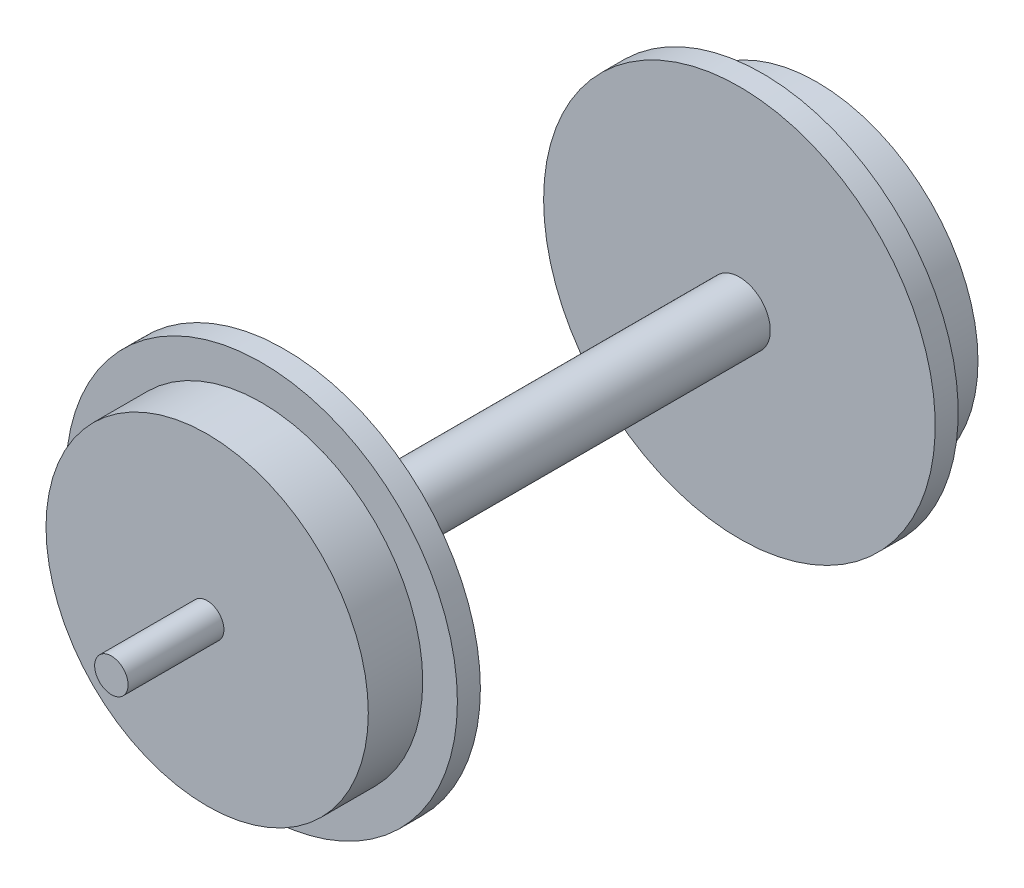
ISO-10303-21;
HEADER;
FILE_DESCRIPTION(('STEP AP214'),'2;1');
FILE_NAME('part.step','',(''),(''),'','','');
FILE_SCHEMA(('AUTOMOTIVE_DESIGN { 1 0 10303 214 1 1 1 1 }'));
ENDSEC;
DATA;
#1=APPLICATION_CONTEXT('core data for automotive mechanical design processes');
#2=APPLICATION_PROTOCOL_DEFINITION('international standard','automotive_design',2000,#1);
#3=PRODUCT_CONTEXT('',#1,'mechanical');
#4=PRODUCT('Part','Part','',(#3));
#5=PRODUCT_RELATED_PRODUCT_CATEGORY('part','',(#4));
#6=PRODUCT_DEFINITION_FORMATION('','',#4);
#7=PRODUCT_DEFINITION_CONTEXT('part definition',#1,'design');
#8=PRODUCT_DEFINITION('design','',#6,#7);
#9=PRODUCT_DEFINITION_SHAPE('','',#8);
#10=(LENGTH_UNIT() NAMED_UNIT(*) SI_UNIT(.MILLI.,.METRE.));
#11=(NAMED_UNIT(*) PLANE_ANGLE_UNIT() SI_UNIT($,.RADIAN.));
#12=(NAMED_UNIT(*) SI_UNIT($,.STERADIAN.) SOLID_ANGLE_UNIT());
#13=UNCERTAINTY_MEASURE_WITH_UNIT(LENGTH_MEASURE(1.E-05),#10,'distance_accuracy_value','');
#14=(GEOMETRIC_REPRESENTATION_CONTEXT(3) GLOBAL_UNCERTAINTY_ASSIGNED_CONTEXT((#13)) GLOBAL_UNIT_ASSIGNED_CONTEXT((#10,
#11,#12)) REPRESENTATION_CONTEXT('',''));
#15=CARTESIAN_POINT('',(0.,0.,0.));
#16=DIRECTION('',(0.,0.,1.));
#17=DIRECTION('',(1.,0.,0.));
#18=AXIS2_PLACEMENT_3D('',#15,#16,#17);
#19=CARTESIAN_POINT('',(0.,0.,2.04));
#20=DIRECTION('',(0.,0.,-1.));
#21=DIRECTION('',(-1.,0.,0.));
#22=AXIS2_PLACEMENT_3D('',#19,#20,#21);
#23=CYLINDRICAL_SURFACE('',#22,17.375);
#24=CARTESIAN_POINT('',(0.,0.,2.04));
#25=DIRECTION('',(0.,0.,1.));
#26=DIRECTION('',(1.,0.,0.));
#27=AXIS2_PLACEMENT_3D('',#24,#25,#26);
#28=CIRCLE('',#27,17.375);
#29=CARTESIAN_POINT('',(17.375,0.,2.04));
#30=VERTEX_POINT('',#29);
#31=EDGE_CURVE('E64',#30,#30,#28,.T.);
#32=ORIENTED_EDGE('',*,*,#31,.F.);
#33=EDGE_LOOP('',(#32));
#34=FACE_BOUND('',#33,.T.);
#35=CARTESIAN_POINT('',(0.,0.,0.));
#36=DIRECTION('',(0.,0.,1.));
#37=DIRECTION('',(1.,0.,0.));
#38=AXIS2_PLACEMENT_3D('',#35,#36,#37);
#39=CIRCLE('',#38,17.375);
#40=CARTESIAN_POINT('',(17.375,0.,0.));
#41=VERTEX_POINT('',#40);
#42=EDGE_CURVE('E36',#41,#41,#39,.T.);
#43=ORIENTED_EDGE('',*,*,#42,.T.);
#44=EDGE_LOOP('',(#43));
#45=FACE_BOUND('',#44,.T.);
#46=ADVANCED_FACE('F33',(#34,#45),#23,.T.);
#47=CARTESIAN_POINT('',(0.,0.,2.04));
#48=DIRECTION('',(0.,0.,1.));
#49=DIRECTION('',(1.,0.,0.));
#50=AXIS2_PLACEMENT_3D('',#47,#48,#49);
#51=PLANE('',#50);
#52=CARTESIAN_POINT('',(0.,0.,2.04));
#53=DIRECTION('',(0.,0.,1.));
#54=DIRECTION('',(1.,0.,0.));
#55=AXIS2_PLACEMENT_3D('',#52,#53,#54);
#56=CIRCLE('',#55,14.3);
#57=CARTESIAN_POINT('',(14.3,0.,2.04));
#58=VERTEX_POINT('',#57);
#59=EDGE_CURVE('E45',#58,#58,#56,.T.);
#60=ORIENTED_EDGE('',*,*,#59,.F.);
#61=EDGE_LOOP('',(#60));
#62=FACE_BOUND('',#61,.T.);
#63=ORIENTED_EDGE('',*,*,#31,.T.);
#64=EDGE_LOOP('',(#63));
#65=FACE_BOUND('',#64,.T.);
#66=ADVANCED_FACE('F75',(#62,#65),#51,.T.);
#67=CARTESIAN_POINT('',(0.,0.,0.));
#68=DIRECTION('',(0.,0.,1.));
#69=DIRECTION('',(1.,0.,0.));
#70=AXIS2_PLACEMENT_3D('',#67,#68,#69);
#71=PLANE('',#70);
#72=CARTESIAN_POINT('',(0.,0.,0.));
#73=DIRECTION('',(0.,0.,-1.));
#74=DIRECTION('',(-1.,0.,0.));
#75=AXIS2_PLACEMENT_3D('',#72,#73,#74);
#76=CIRCLE('',#75,2.74);
#77=CARTESIAN_POINT('',(-2.74,0.,0.));
#78=VERTEX_POINT('',#77);
#79=EDGE_CURVE('E40',#78,#78,#76,.T.);
#80=ORIENTED_EDGE('',*,*,#79,.F.);
#81=EDGE_LOOP('',(#80));
#82=FACE_BOUND('',#81,.T.);
#83=ORIENTED_EDGE('',*,*,#42,.F.);
#84=EDGE_LOOP('',(#83));
#85=FACE_BOUND('',#84,.T.);
#86=ADVANCED_FACE('F72',(#82,#85),#71,.F.);
#87=CARTESIAN_POINT('',(0.,0.,6.87));
#88=DIRECTION('',(0.,0.,-1.));
#89=DIRECTION('',(-1.,0.,0.));
#90=AXIS2_PLACEMENT_3D('',#87,#88,#89);
#91=CYLINDRICAL_SURFACE('',#90,14.3);
#92=CARTESIAN_POINT('',(0.,0.,6.87));
#93=DIRECTION('',(0.,0.,1.));
#94=DIRECTION('',(1.,0.,0.));
#95=AXIS2_PLACEMENT_3D('',#92,#93,#94);
#96=CIRCLE('',#95,14.3);
#97=CARTESIAN_POINT('',(14.3,0.,6.87));
#98=VERTEX_POINT('',#97);
#99=EDGE_CURVE('E59',#98,#98,#96,.T.);
#100=ORIENTED_EDGE('',*,*,#99,.F.);
#101=EDGE_LOOP('',(#100));
#102=FACE_BOUND('',#101,.T.);
#103=ORIENTED_EDGE('',*,*,#59,.T.);
#104=EDGE_LOOP('',(#103));
#105=FACE_BOUND('',#104,.T.);
#106=ADVANCED_FACE('F74',(#102,#105),#91,.T.);
#107=CARTESIAN_POINT('',(0.,0.,6.87));
#108=DIRECTION('',(0.,0.,1.));
#109=DIRECTION('',(1.,0.,0.));
#110=AXIS2_PLACEMENT_3D('',#107,#108,#109);
#111=PLANE('',#110);
#112=CARTESIAN_POINT('',(0.,0.,6.87));
#113=DIRECTION('',(0.,0.,1.));
#114=DIRECTION('',(1.,0.,0.));
#115=AXIS2_PLACEMENT_3D('',#112,#113,#114);
#116=CIRCLE('',#115,1.485);
#117=CARTESIAN_POINT('',(1.485,0.,6.87));
#118=VERTEX_POINT('',#117);
#119=EDGE_CURVE('E222',#118,#118,#116,.T.);
#120=ORIENTED_EDGE('',*,*,#119,.F.);
#121=EDGE_LOOP('',(#120));
#122=FACE_BOUND('',#121,.T.);
#123=ORIENTED_EDGE('',*,*,#99,.T.);
#124=EDGE_LOOP('',(#123));
#125=FACE_BOUND('',#124,.T.);
#126=ADVANCED_FACE('F81',(#122,#125),#111,.T.);
#127=CARTESIAN_POINT('',(0.,0.,-40.36));
#128=DIRECTION('',(0.,0.,1.));
#129=DIRECTION('',(1.,0.,0.));
#130=AXIS2_PLACEMENT_3D('',#127,#128,#129);
#131=CYLINDRICAL_SURFACE('',#130,2.74);
#132=CARTESIAN_POINT('',(0.,0.,-40.36));
#133=DIRECTION('',(0.,0.,-1.));
#134=DIRECTION('',(-1.,0.,0.));
#135=AXIS2_PLACEMENT_3D('',#132,#133,#134);
#136=CIRCLE('',#135,2.74);
#137=CARTESIAN_POINT('',(-2.74,0.,-40.36));
#138=VERTEX_POINT('',#137);
#139=EDGE_CURVE('E54',#138,#138,#136,.T.);
#140=ORIENTED_EDGE('',*,*,#139,.F.);
#141=EDGE_LOOP('',(#140));
#142=FACE_BOUND('',#141,.T.);
#143=ORIENTED_EDGE('',*,*,#79,.T.);
#144=EDGE_LOOP('',(#143));
#145=FACE_BOUND('',#144,.T.);
#146=ADVANCED_FACE('F112',(#142,#145),#131,.T.);
#147=CARTESIAN_POINT('',(0.,0.,-42.4));
#148=DIRECTION('',(0.,0.,1.));
#149=DIRECTION('',(1.,0.,0.));
#150=AXIS2_PLACEMENT_3D('',#147,#148,#149);
#151=CYLINDRICAL_SURFACE('',#150,17.375);
#152=CARTESIAN_POINT('',(0.,0.,-42.4));
#153=DIRECTION('',(0.,0.,-1.));
#154=DIRECTION('',(-1.,0.,0.));
#155=AXIS2_PLACEMENT_3D('',#152,#153,#154);
#156=CIRCLE('',#155,17.375);
#157=CARTESIAN_POINT('',(-17.375,0.,-42.4));
#158=VERTEX_POINT('',#157);
#159=EDGE_CURVE('E51',#158,#158,#156,.T.);
#160=ORIENTED_EDGE('',*,*,#159,.F.);
#161=EDGE_LOOP('',(#160));
#162=FACE_BOUND('',#161,.T.);
#163=CARTESIAN_POINT('',(0.,0.,-40.36));
#164=DIRECTION('',(0.,0.,-1.));
#165=DIRECTION('',(-1.,0.,0.));
#166=AXIS2_PLACEMENT_3D('',#163,#164,#165);
#167=CIRCLE('',#166,17.375);
#168=CARTESIAN_POINT('',(-17.375,0.,-40.36));
#169=VERTEX_POINT('',#168);
#170=EDGE_CURVE('E55',#169,#169,#167,.T.);
#171=ORIENTED_EDGE('',*,*,#170,.T.);
#172=EDGE_LOOP('',(#171));
#173=FACE_BOUND('',#172,.T.);
#174=ADVANCED_FACE('F117',(#162,#173),#151,.T.);
#175=CARTESIAN_POINT('',(0.,0.,-42.4));
#176=DIRECTION('',(0.,0.,-1.));
#177=DIRECTION('',(-1.,0.,0.));
#178=AXIS2_PLACEMENT_3D('',#175,#176,#177);
#179=PLANE('',#178);
#180=CARTESIAN_POINT('',(0.,0.,-42.4));
#181=DIRECTION('',(0.,0.,-1.));
#182=DIRECTION('',(-1.,0.,0.));
#183=AXIS2_PLACEMENT_3D('',#180,#181,#182);
#184=CIRCLE('',#183,14.3);
#185=CARTESIAN_POINT('',(-14.3,0.,-42.4));
#186=VERTEX_POINT('',#185);
#187=EDGE_CURVE('E10',#186,#186,#184,.T.);
#188=ORIENTED_EDGE('',*,*,#187,.F.);
#189=EDGE_LOOP('',(#188));
#190=FACE_BOUND('',#189,.T.);
#191=ORIENTED_EDGE('',*,*,#159,.T.);
#192=EDGE_LOOP('',(#191));
#193=FACE_BOUND('',#192,.T.);
#194=ADVANCED_FACE('F127',(#190,#193),#179,.T.);
#195=CARTESIAN_POINT('',(0.,0.,-40.36));
#196=DIRECTION('',(0.,0.,-1.));
#197=DIRECTION('',(-1.,0.,0.));
#198=AXIS2_PLACEMENT_3D('',#195,#196,#197);
#199=PLANE('',#198);
#200=ORIENTED_EDGE('',*,*,#139,.T.);
#201=EDGE_LOOP('',(#200));
#202=FACE_BOUND('',#201,.T.);
#203=ORIENTED_EDGE('',*,*,#170,.F.);
#204=EDGE_LOOP('',(#203));
#205=FACE_BOUND('',#204,.T.);
#206=ADVANCED_FACE('F135',(#202,#205),#199,.F.);
#207=CARTESIAN_POINT('',(0.,0.,-47.23));
#208=DIRECTION('',(0.,0.,1.));
#209=DIRECTION('',(1.,0.,0.));
#210=AXIS2_PLACEMENT_3D('',#207,#208,#209);
#211=CYLINDRICAL_SURFACE('',#210,14.3);
#212=CARTESIAN_POINT('',(0.,0.,-47.23));
#213=DIRECTION('',(0.,0.,-1.));
#214=DIRECTION('',(-1.,0.,0.));
#215=AXIS2_PLACEMENT_3D('',#212,#213,#214);
#216=CIRCLE('',#215,14.3);
#217=CARTESIAN_POINT('',(-14.3,0.,-47.23));
#218=VERTEX_POINT('',#217);
#219=EDGE_CURVE('E49',#218,#218,#216,.T.);
#220=ORIENTED_EDGE('',*,*,#219,.F.);
#221=EDGE_LOOP('',(#220));
#222=FACE_BOUND('',#221,.T.);
#223=ORIENTED_EDGE('',*,*,#187,.T.);
#224=EDGE_LOOP('',(#223));
#225=FACE_BOUND('',#224,.T.);
#226=ADVANCED_FACE('F140',(#222,#225),#211,.T.);
#227=CARTESIAN_POINT('',(0.,0.,-47.23));
#228=DIRECTION('',(0.,0.,-1.));
#229=DIRECTION('',(-1.,0.,0.));
#230=AXIS2_PLACEMENT_3D('',#227,#228,#229);
#231=PLANE('',#230);
#232=CARTESIAN_POINT('',(0.,0.,-47.23));
#233=DIRECTION('',(0.,0.,-1.));
#234=DIRECTION('',(-1.,0.,0.));
#235=AXIS2_PLACEMENT_3D('',#232,#233,#234);
#236=CIRCLE('',#235,1.485);
#237=CARTESIAN_POINT('',(-1.485,0.,-47.23));
#238=VERTEX_POINT('',#237);
#239=EDGE_CURVE('E221',#238,#238,#236,.T.);
#240=ORIENTED_EDGE('',*,*,#239,.F.);
#241=EDGE_LOOP('',(#240));
#242=FACE_BOUND('',#241,.T.);
#243=ORIENTED_EDGE('',*,*,#219,.T.);
#244=EDGE_LOOP('',(#243));
#245=FACE_BOUND('',#244,.T.);
#246=ADVANCED_FACE('F157',(#242,#245),#231,.T.);
#247=CARTESIAN_POINT('',(0.,0.,-55.73));
#248=DIRECTION('',(0.,0.,1.));
#249=DIRECTION('',(1.,0.,0.));
#250=AXIS2_PLACEMENT_3D('',#247,#248,#249);
#251=CYLINDRICAL_SURFACE('',#250,1.485);
#252=CARTESIAN_POINT('',(0.,0.,-55.73));
#253=DIRECTION('',(0.,0.,-1.));
#254=DIRECTION('',(-1.,0.,0.));
#255=AXIS2_PLACEMENT_3D('',#252,#253,#254);
#256=CIRCLE('',#255,1.485);
#257=CARTESIAN_POINT('',(-1.485,0.,-55.73));
#258=VERTEX_POINT('',#257);
#259=EDGE_CURVE('E225',#258,#258,#256,.T.);
#260=ORIENTED_EDGE('',*,*,#259,.F.);
#261=EDGE_LOOP('',(#260));
#262=FACE_BOUND('',#261,.T.);
#263=ORIENTED_EDGE('',*,*,#239,.T.);
#264=EDGE_LOOP('',(#263));
#265=FACE_BOUND('',#264,.T.);
#266=ADVANCED_FACE('F167',(#262,#265),#251,.T.);
#267=CARTESIAN_POINT('',(0.,0.,-55.73));
#268=DIRECTION('',(0.,0.,-1.));
#269=DIRECTION('',(-1.,0.,0.));
#270=AXIS2_PLACEMENT_3D('',#267,#268,#269);
#271=PLANE('',#270);
#272=ORIENTED_EDGE('',*,*,#259,.T.);
#273=EDGE_LOOP('',(#272));
#274=FACE_BOUND('',#273,.T.);
#275=ADVANCED_FACE('F177',(#274),#271,.T.);
#276=CARTESIAN_POINT('',(0.,0.,15.37));
#277=DIRECTION('',(0.,0.,-1.));
#278=DIRECTION('',(-1.,0.,0.));
#279=AXIS2_PLACEMENT_3D('',#276,#277,#278);
#280=CYLINDRICAL_SURFACE('',#279,1.485);
#281=CARTESIAN_POINT('',(0.,0.,15.37));
#282=DIRECTION('',(0.,0.,1.));
#283=DIRECTION('',(1.,0.,0.));
#284=AXIS2_PLACEMENT_3D('',#281,#282,#283);
#285=CIRCLE('',#284,1.485);
#286=CARTESIAN_POINT('',(1.485,0.,15.37));
#287=VERTEX_POINT('',#286);
#288=EDGE_CURVE('E220',#287,#287,#285,.T.);
#289=ORIENTED_EDGE('',*,*,#288,.F.);
#290=EDGE_LOOP('',(#289));
#291=FACE_BOUND('',#290,.T.);
#292=ORIENTED_EDGE('',*,*,#119,.T.);
#293=EDGE_LOOP('',(#292));
#294=FACE_BOUND('',#293,.T.);
#295=ADVANCED_FACE('F187',(#291,#294),#280,.T.);
#296=CARTESIAN_POINT('',(0.,0.,15.37));
#297=DIRECTION('',(0.,0.,1.));
#298=DIRECTION('',(1.,0.,0.));
#299=AXIS2_PLACEMENT_3D('',#296,#297,#298);
#300=PLANE('',#299);
#301=ORIENTED_EDGE('',*,*,#288,.T.);
#302=EDGE_LOOP('',(#301));
#303=FACE_BOUND('',#302,.T.);
#304=ADVANCED_FACE('F204',(#303),#300,.T.);
#305=CLOSED_SHELL('',(#46,#66,#86,#106,#126,#146,#174,#194,#206,#226,#246,#266,#275,#295,#304));
#306=MANIFOLD_SOLID_BREP('B2',#305);
#307=ADVANCED_BREP_SHAPE_REPRESENTATION('',(#18,#306),#14);
#308=SHAPE_DEFINITION_REPRESENTATION(#9,#307);
ENDSEC;
END-ISO-10303-21;
